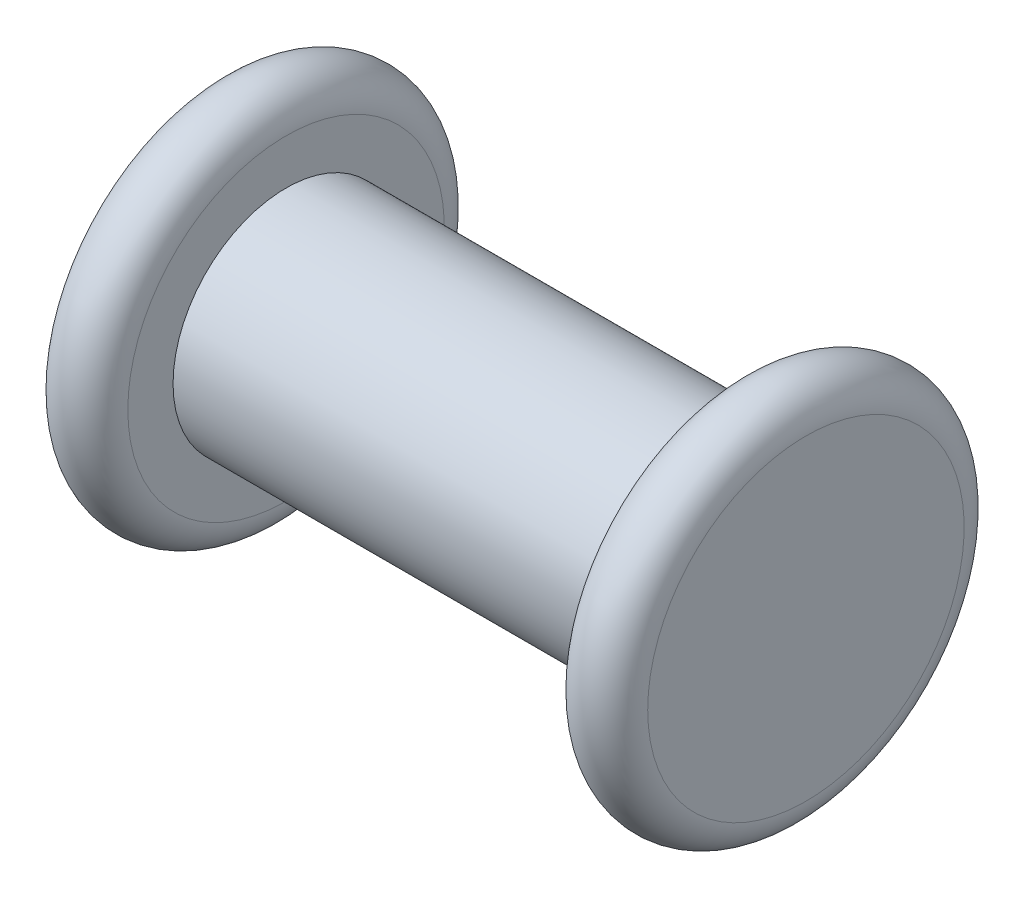
ISO-10303-21;
HEADER;
FILE_DESCRIPTION(('STEP AP214'),'2;1');
FILE_NAME('part.step','',(''),(''),'','','');
FILE_SCHEMA(('AUTOMOTIVE_DESIGN { 1 0 10303 214 1 1 1 1 }'));
ENDSEC;
DATA;
#1=APPLICATION_CONTEXT('core data for automotive mechanical design processes');
#2=APPLICATION_PROTOCOL_DEFINITION('international standard','automotive_design',2000,#1);
#3=PRODUCT_CONTEXT('',#1,'mechanical');
#4=PRODUCT('Part','Part','',(#3));
#5=PRODUCT_RELATED_PRODUCT_CATEGORY('part','',(#4));
#6=PRODUCT_DEFINITION_FORMATION('','',#4);
#7=PRODUCT_DEFINITION_CONTEXT('part definition',#1,'design');
#8=PRODUCT_DEFINITION('design','',#6,#7);
#9=PRODUCT_DEFINITION_SHAPE('','',#8);
#10=(LENGTH_UNIT() NAMED_UNIT(*) SI_UNIT(.MILLI.,.METRE.));
#11=(NAMED_UNIT(*) PLANE_ANGLE_UNIT() SI_UNIT($,.RADIAN.));
#12=(NAMED_UNIT(*) SI_UNIT($,.STERADIAN.) SOLID_ANGLE_UNIT());
#13=UNCERTAINTY_MEASURE_WITH_UNIT(LENGTH_MEASURE(1.E-05),#10,'distance_accuracy_value','');
#14=(GEOMETRIC_REPRESENTATION_CONTEXT(3) GLOBAL_UNCERTAINTY_ASSIGNED_CONTEXT((#13)) GLOBAL_UNIT_ASSIGNED_CONTEXT((#10,
#11,#12)) REPRESENTATION_CONTEXT('',''));
#15=CARTESIAN_POINT('',(0.,0.,0.));
#16=DIRECTION('',(0.,0.,1.));
#17=DIRECTION('',(1.,0.,0.));
#18=AXIS2_PLACEMENT_3D('',#15,#16,#17);
#19=CARTESIAN_POINT('',(8.255,0.,0.));
#20=DIRECTION('',(-1.,0.,0.));
#21=DIRECTION('',(0.,0.,1.));
#22=AXIS2_PLACEMENT_3D('',#19,#20,#21);
#23=PLANE('',#22);
#24=CARTESIAN_POINT('',(8.255,0.,0.));
#25=DIRECTION('',(-1.,0.,0.));
#26=DIRECTION('',(0.,0.,1.));
#27=AXIS2_PLACEMENT_3D('',#24,#25,#26);
#28=CIRCLE('',#27,4.445);
#29=CARTESIAN_POINT('',(8.255,0.,4.445));
#30=VERTEX_POINT('',#29);
#31=EDGE_CURVE('E10',#30,#30,#28,.T.);
#32=ORIENTED_EDGE('',*,*,#31,.F.);
#33=EDGE_LOOP('',(#32));
#34=FACE_BOUND('',#33,.T.);
#35=ADVANCED_FACE('F29',(#34),#23,.F.);
#36=CARTESIAN_POINT('',(7.3025,0.,0.));
#37=DIRECTION('',(-1.,0.,0.));
#38=DIRECTION('',(0.,0.,1.));
#39=AXIS2_PLACEMENT_3D('',#36,#37,#38);
#40=TOROIDAL_SURFACE('',#39,4.445,0.952499999999999);
#41=CARTESIAN_POINT('',(6.35,0.,0.));
#42=DIRECTION('',(-1.,0.,0.));
#43=DIRECTION('',(0.,0.,1.));
#44=AXIS2_PLACEMENT_3D('',#41,#42,#43);
#45=CIRCLE('',#44,4.445);
#46=CARTESIAN_POINT('',(6.35,0.,4.445));
#47=VERTEX_POINT('',#46);
#48=EDGE_CURVE('E35',#47,#47,#45,.T.);
#49=ORIENTED_EDGE('',*,*,#48,.F.);
#50=EDGE_LOOP('',(#49));
#51=FACE_BOUND('',#50,.T.);
#52=ORIENTED_EDGE('',*,*,#31,.T.);
#53=EDGE_LOOP('',(#52));
#54=FACE_BOUND('',#53,.T.);
#55=ADVANCED_FACE('F77',(#51,#54),#40,.T.);
#56=CARTESIAN_POINT('',(6.35,4.445,0.));
#57=DIRECTION('',(1.,0.,0.));
#58=DIRECTION('',(0.,0.,-1.));
#59=AXIS2_PLACEMENT_3D('',#56,#57,#58);
#60=PLANE('',#59);
#61=CARTESIAN_POINT('',(6.35,0.,0.));
#62=DIRECTION('',(-1.,0.,0.));
#63=DIRECTION('',(0.,0.,1.));
#64=AXIS2_PLACEMENT_3D('',#61,#62,#63);
#65=CIRCLE('',#64,3.175);
#66=CARTESIAN_POINT('',(6.35,0.,3.175));
#67=VERTEX_POINT('',#66);
#68=EDGE_CURVE('E39',#67,#67,#65,.T.);
#69=ORIENTED_EDGE('',*,*,#68,.F.);
#70=EDGE_LOOP('',(#69));
#71=FACE_BOUND('',#70,.T.);
#72=ORIENTED_EDGE('',*,*,#48,.T.);
#73=EDGE_LOOP('',(#72));
#74=FACE_BOUND('',#73,.T.);
#75=ADVANCED_FACE('F72',(#71,#74),#60,.F.);
#76=CARTESIAN_POINT('',(-39.2428486293206,0.,0.));
#77=DIRECTION('',(-1.,0.,0.));
#78=DIRECTION('',(0.,0.,1.));
#79=AXIS2_PLACEMENT_3D('',#76,#77,#78);
#80=CYLINDRICAL_SURFACE('',#79,3.175);
#81=CARTESIAN_POINT('',(-6.34999999999999,0.,0.));
#82=DIRECTION('',(-1.,0.,0.));
#83=DIRECTION('',(0.,0.,1.));
#84=AXIS2_PLACEMENT_3D('',#81,#82,#83);
#85=CIRCLE('',#84,3.175);
#86=CARTESIAN_POINT('',(-6.34999999999999,0.,3.175));
#87=VERTEX_POINT('',#86);
#88=EDGE_CURVE('E43',#87,#87,#85,.T.);
#89=ORIENTED_EDGE('',*,*,#88,.F.);
#90=EDGE_LOOP('',(#89));
#91=FACE_BOUND('',#90,.T.);
#92=ORIENTED_EDGE('',*,*,#68,.T.);
#93=EDGE_LOOP('',(#92));
#94=FACE_BOUND('',#93,.T.);
#95=ADVANCED_FACE('F66',(#91,#94),#80,.T.);
#96=CARTESIAN_POINT('',(-6.35,4.445,0.));
#97=DIRECTION('',(-1.,0.,0.));
#98=DIRECTION('',(0.,0.,1.));
#99=AXIS2_PLACEMENT_3D('',#96,#97,#98);
#100=PLANE('',#99);
#101=CARTESIAN_POINT('',(-6.35,0.,0.));
#102=DIRECTION('',(-1.,0.,0.));
#103=DIRECTION('',(0.,0.,1.));
#104=AXIS2_PLACEMENT_3D('',#101,#102,#103);
#105=CIRCLE('',#104,4.445);
#106=CARTESIAN_POINT('',(-6.35,0.,4.445));
#107=VERTEX_POINT('',#106);
#108=EDGE_CURVE('E48',#107,#107,#105,.T.);
#109=ORIENTED_EDGE('',*,*,#108,.F.);
#110=EDGE_LOOP('',(#109));
#111=FACE_BOUND('',#110,.T.);
#112=ORIENTED_EDGE('',*,*,#88,.T.);
#113=EDGE_LOOP('',(#112));
#114=FACE_BOUND('',#113,.T.);
#115=ADVANCED_FACE('F60',(#111,#114),#100,.F.);
#116=CARTESIAN_POINT('',(-7.3025,0.,0.));
#117=DIRECTION('',(-1.,0.,0.));
#118=DIRECTION('',(0.,0.,1.));
#119=AXIS2_PLACEMENT_3D('',#116,#117,#118);
#120=TOROIDAL_SURFACE('',#119,4.445,0.952499999999999);
#121=CARTESIAN_POINT('',(-8.255,0.,0.));
#122=DIRECTION('',(-1.,0.,0.));
#123=DIRECTION('',(0.,0.,1.));
#124=AXIS2_PLACEMENT_3D('',#121,#122,#123);
#125=CIRCLE('',#124,4.445);
#126=CARTESIAN_POINT('',(-8.255,0.,4.445));
#127=VERTEX_POINT('',#126);
#128=EDGE_CURVE('E51',#127,#127,#125,.T.);
#129=ORIENTED_EDGE('',*,*,#128,.F.);
#130=EDGE_LOOP('',(#129));
#131=FACE_BOUND('',#130,.T.);
#132=ORIENTED_EDGE('',*,*,#108,.T.);
#133=EDGE_LOOP('',(#132));
#134=FACE_BOUND('',#133,.T.);
#135=ADVANCED_FACE('F57',(#131,#134),#120,.T.);
#136=CARTESIAN_POINT('',(-8.255,0.,0.));
#137=DIRECTION('',(1.,0.,0.));
#138=DIRECTION('',(0.,0.,-1.));
#139=AXIS2_PLACEMENT_3D('',#136,#137,#138);
#140=PLANE('',#139);
#141=ORIENTED_EDGE('',*,*,#128,.T.);
#142=EDGE_LOOP('',(#141));
#143=FACE_BOUND('',#142,.T.);
#144=ADVANCED_FACE('F55',(#143),#140,.F.);
#145=CLOSED_SHELL('',(#35,#55,#75,#95,#115,#135,#144));
#146=MANIFOLD_SOLID_BREP('B2',#145);
#147=ADVANCED_BREP_SHAPE_REPRESENTATION('',(#18,#146),#14);
#148=SHAPE_DEFINITION_REPRESENTATION(#9,#147);
ENDSEC;
END-ISO-10303-21;
